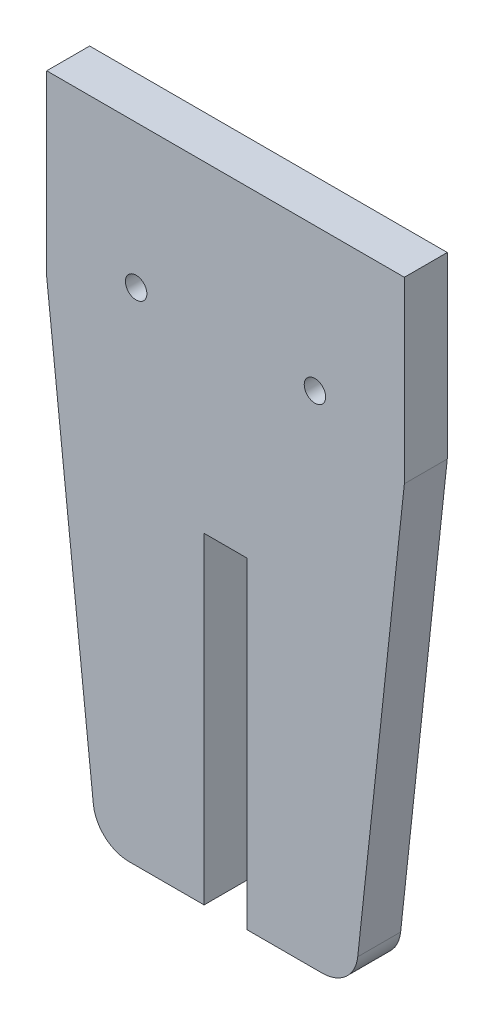
ISO-10303-21;
HEADER;
FILE_DESCRIPTION(('STEP AP214'),'2;1');
FILE_NAME('part.step','',(''),(''),'','','');
FILE_SCHEMA(('AUTOMOTIVE_DESIGN { 1 0 10303 214 1 1 1 1 }'));
ENDSEC;
DATA;
#1=APPLICATION_CONTEXT('core data for automotive mechanical design processes');
#2=APPLICATION_PROTOCOL_DEFINITION('international standard','automotive_design',2000,#1);
#3=PRODUCT_CONTEXT('',#1,'mechanical');
#4=PRODUCT('Part','Part','',(#3));
#5=PRODUCT_RELATED_PRODUCT_CATEGORY('part','',(#4));
#6=PRODUCT_DEFINITION_FORMATION('','',#4);
#7=PRODUCT_DEFINITION_CONTEXT('part definition',#1,'design');
#8=PRODUCT_DEFINITION('design','',#6,#7);
#9=PRODUCT_DEFINITION_SHAPE('','',#8);
#10=(LENGTH_UNIT() NAMED_UNIT(*) SI_UNIT(.MILLI.,.METRE.));
#11=(NAMED_UNIT(*) PLANE_ANGLE_UNIT() SI_UNIT($,.RADIAN.));
#12=(NAMED_UNIT(*) SI_UNIT($,.STERADIAN.) SOLID_ANGLE_UNIT());
#13=UNCERTAINTY_MEASURE_WITH_UNIT(LENGTH_MEASURE(1.E-05),#10,'distance_accuracy_value','');
#14=(GEOMETRIC_REPRESENTATION_CONTEXT(3) GLOBAL_UNCERTAINTY_ASSIGNED_CONTEXT((#13)) GLOBAL_UNIT_ASSIGNED_CONTEXT((#10,
#11,#12)) REPRESENTATION_CONTEXT('',''));
#15=CARTESIAN_POINT('',(0.,0.,0.));
#16=DIRECTION('',(0.,0.,1.));
#17=DIRECTION('',(1.,0.,0.));
#18=AXIS2_PLACEMENT_3D('',#15,#16,#17);
#19=CARTESIAN_POINT('',(18.,-90.,6.));
#20=DIRECTION('',(0.,1.,0.));
#21=DIRECTION('',(0.,0.,1.));
#22=AXIS2_PLACEMENT_3D('',#19,#20,#21);
#23=PLANE('',#22);
#24=DIRECTION('',(1.,0.,0.));
#25=VECTOR('',#24,1.);
#26=CARTESIAN_POINT('',(18.,-90.,0.));
#27=LINE('',#26,#25);
#28=CARTESIAN_POINT('',(3.,-90.,0.));
#29=VERTEX_POINT('',#28);
#30=CARTESIAN_POINT('',(13.5095510373289,-90.,0.));
#31=VERTEX_POINT('',#30);
#32=EDGE_CURVE('E156',#29,#31,#27,.T.);
#33=ORIENTED_EDGE('',*,*,#32,.T.);
#34=DIRECTION('',(0.,0.,-1.));
#35=VECTOR('',#34,1.);
#36=CARTESIAN_POINT('',(13.5095510373289,-90.,6.));
#37=LINE('',#36,#35);
#38=CARTESIAN_POINT('',(13.5095510373289,-90.,6.));
#39=VERTEX_POINT('',#38);
#40=EDGE_CURVE('E11',#31,#39,#37,.F.);
#41=ORIENTED_EDGE('',*,*,#40,.T.);
#42=DIRECTION('',(1.,0.,0.));
#43=VECTOR('',#42,1.);
#44=CARTESIAN_POINT('',(18.,-90.,6.));
#45=LINE('',#44,#43);
#46=CARTESIAN_POINT('',(3.,-90.,6.));
#47=VERTEX_POINT('',#46);
#48=EDGE_CURVE('E196',#47,#39,#45,.T.);
#49=ORIENTED_EDGE('',*,*,#48,.F.);
#50=DIRECTION('',(0.,0.,1.));
#51=VECTOR('',#50,1.);
#52=CARTESIAN_POINT('',(3.,-90.,0.));
#53=LINE('',#52,#51);
#54=EDGE_CURVE('E168',#29,#47,#53,.T.);
#55=ORIENTED_EDGE('',*,*,#54,.F.);
#56=EDGE_LOOP('',(#33,#41,#49,#55));
#57=FACE_BOUND('',#56,.T.);
#58=ADVANCED_FACE('F39',(#57),#23,.F.);
#59=CARTESIAN_POINT('',(-25.,0.,6.));
#60=DIRECTION('',(1.,0.,0.));
#61=DIRECTION('',(0.,1.,0.));
#62=AXIS2_PLACEMENT_3D('',#59,#60,#61);
#63=PLANE('',#62);
#64=DIRECTION('',(0.,-1.,0.));
#65=VECTOR('',#64,1.);
#66=CARTESIAN_POINT('',(-25.,0.,0.));
#67=LINE('',#66,#65);
#68=CARTESIAN_POINT('',(-25.,0.,0.));
#69=VERTEX_POINT('',#68);
#70=CARTESIAN_POINT('',(-25.,-25.,0.));
#71=VERTEX_POINT('',#70);
#72=EDGE_CURVE('E186',#69,#71,#67,.T.);
#73=ORIENTED_EDGE('',*,*,#72,.T.);
#74=DIRECTION('',(0.,0.,-1.));
#75=VECTOR('',#74,1.);
#76=CARTESIAN_POINT('',(-25.,-25.,6.));
#77=LINE('',#76,#75);
#78=CARTESIAN_POINT('',(-25.,-25.,6.));
#79=VERTEX_POINT('',#78);
#80=EDGE_CURVE('E239',#79,#71,#77,.T.);
#81=ORIENTED_EDGE('',*,*,#80,.F.);
#82=DIRECTION('',(0.,-1.,0.));
#83=VECTOR('',#82,1.);
#84=CARTESIAN_POINT('',(-25.,0.,6.));
#85=LINE('',#84,#83);
#86=CARTESIAN_POINT('',(-25.,0.,6.));
#87=VERTEX_POINT('',#86);
#88=EDGE_CURVE('E187',#87,#79,#85,.T.);
#89=ORIENTED_EDGE('',*,*,#88,.F.);
#90=DIRECTION('',(0.,0.,-1.));
#91=VECTOR('',#90,1.);
#92=CARTESIAN_POINT('',(-25.,0.,6.));
#93=LINE('',#92,#91);
#94=EDGE_CURVE('E209',#87,#69,#93,.T.);
#95=ORIENTED_EDGE('',*,*,#94,.T.);
#96=EDGE_LOOP('',(#73,#81,#89,#95));
#97=FACE_BOUND('',#96,.T.);
#98=ADVANCED_FACE('F285',(#97),#63,.F.);
#99=CARTESIAN_POINT('',(-25.,-25.,6.));
#100=DIRECTION('',(0.994251140256692,0.107073199719951,0.));
#101=DIRECTION('',(-0.107073199719951,0.994251140256692,0.));
#102=AXIS2_PLACEMENT_3D('',#99,#100,#101);
#103=PLANE('',#102);
#104=DIRECTION('',(0.107073199719951,-0.994251140256692,0.));
#105=VECTOR('',#104,1.);
#106=CARTESIAN_POINT('',(-25.,-25.,0.));
#107=LINE('',#106,#105);
#108=CARTESIAN_POINT('',(-18.4808067386123,-85.5353659985997,0.));
#109=VERTEX_POINT('',#108);
#110=EDGE_CURVE('E213',#71,#109,#107,.T.);
#111=ORIENTED_EDGE('',*,*,#110,.T.);
#112=DIRECTION('',(0.,0.,-1.));
#113=VECTOR('',#112,1.);
#114=CARTESIAN_POINT('',(-18.4808067386123,-85.5353659985997,6.));
#115=LINE('',#114,#113);
#116=CARTESIAN_POINT('',(-18.4808067386123,-85.5353659985997,6.));
#117=VERTEX_POINT('',#116);
#118=EDGE_CURVE('E253',#109,#117,#115,.F.);
#119=ORIENTED_EDGE('',*,*,#118,.T.);
#120=DIRECTION('',(0.107073199719951,-0.994251140256692,0.));
#121=VECTOR('',#120,1.);
#122=CARTESIAN_POINT('',(-25.,-25.,6.));
#123=LINE('',#122,#121);
#124=EDGE_CURVE('E191',#79,#117,#123,.T.);
#125=ORIENTED_EDGE('',*,*,#124,.F.);
#126=ORIENTED_EDGE('',*,*,#80,.T.);
#127=EDGE_LOOP('',(#111,#119,#125,#126));
#128=FACE_BOUND('',#127,.T.);
#129=ADVANCED_FACE('F287',(#128),#103,.F.);
#130=CARTESIAN_POINT('',(-13.5095510373289,-90.,6.));
#131=VERTEX_POINT('',#130);
#132=CARTESIAN_POINT('',(-3.,-90.,6.));
#133=VERTEX_POINT('',#132);
#134=EDGE_CURVE('E197',#131,#133,#45,.T.);
#135=ORIENTED_EDGE('',*,*,#134,.F.);
#136=DIRECTION('',(0.,0.,-1.));
#137=VECTOR('',#136,1.);
#138=CARTESIAN_POINT('',(-13.5095510373289,-90.,6.));
#139=LINE('',#138,#137);
#140=CARTESIAN_POINT('',(-13.5095510373289,-90.,0.));
#141=VERTEX_POINT('',#140);
#142=EDGE_CURVE('E243',#131,#141,#139,.T.);
#143=ORIENTED_EDGE('',*,*,#142,.T.);
#144=CARTESIAN_POINT('',(-3.,-90.,0.));
#145=VERTEX_POINT('',#144);
#146=EDGE_CURVE('E217',#141,#145,#27,.T.);
#147=ORIENTED_EDGE('',*,*,#146,.T.);
#148=DIRECTION('',(0.,0.,1.));
#149=VECTOR('',#148,1.);
#150=CARTESIAN_POINT('',(-3.,-90.,0.));
#151=LINE('',#150,#149);
#152=EDGE_CURVE('E172',#145,#133,#151,.T.);
#153=ORIENTED_EDGE('',*,*,#152,.T.);
#154=EDGE_LOOP('',(#135,#143,#147,#153));
#155=FACE_BOUND('',#154,.T.);
#156=ADVANCED_FACE('F295',(#155),#23,.F.);
#157=CARTESIAN_POINT('',(25.,-25.,6.));
#158=DIRECTION('',(-0.994251140256692,0.107073199719951,0.));
#159=DIRECTION('',(-0.107073199719951,-0.994251140256692,0.));
#160=AXIS2_PLACEMENT_3D('',#157,#158,#159);
#161=PLANE('',#160);
#162=DIRECTION('',(0.107073199719951,0.994251140256692,0.));
#163=VECTOR('',#162,1.);
#164=CARTESIAN_POINT('',(25.,-25.,6.));
#165=LINE('',#164,#163);
#166=CARTESIAN_POINT('',(18.4808067386123,-85.5353659985997,6.));
#167=VERTEX_POINT('',#166);
#168=CARTESIAN_POINT('',(25.,-25.,6.));
#169=VERTEX_POINT('',#168);
#170=EDGE_CURVE('E200',#167,#169,#165,.T.);
#171=ORIENTED_EDGE('',*,*,#170,.F.);
#172=DIRECTION('',(0.,0.,-1.));
#173=VECTOR('',#172,1.);
#174=CARTESIAN_POINT('',(18.4808067386123,-85.5353659985997,6.));
#175=LINE('',#174,#173);
#176=CARTESIAN_POINT('',(18.4808067386123,-85.5353659985997,0.));
#177=VERTEX_POINT('',#176);
#178=EDGE_CURVE('E49',#167,#177,#175,.T.);
#179=ORIENTED_EDGE('',*,*,#178,.T.);
#180=DIRECTION('',(0.107073199719951,0.994251140256692,0.));
#181=VECTOR('',#180,1.);
#182=CARTESIAN_POINT('',(25.,-25.,0.));
#183=LINE('',#182,#181);
#184=CARTESIAN_POINT('',(25.,-25.,0.));
#185=VERTEX_POINT('',#184);
#186=EDGE_CURVE('E220',#177,#185,#183,.T.);
#187=ORIENTED_EDGE('',*,*,#186,.T.);
#188=DIRECTION('',(0.,0.,-1.));
#189=VECTOR('',#188,1.);
#190=CARTESIAN_POINT('',(25.,-25.,6.));
#191=LINE('',#190,#189);
#192=EDGE_CURVE('E235',#169,#185,#191,.T.);
#193=ORIENTED_EDGE('',*,*,#192,.F.);
#194=EDGE_LOOP('',(#171,#179,#187,#193));
#195=FACE_BOUND('',#194,.T.);
#196=ADVANCED_FACE('F266',(#195),#161,.F.);
#197=CARTESIAN_POINT('',(25.,0.,6.));
#198=DIRECTION('',(-1.,0.,0.));
#199=DIRECTION('',(0.,-1.,0.));
#200=AXIS2_PLACEMENT_3D('',#197,#198,#199);
#201=PLANE('',#200);
#202=DIRECTION('',(0.,1.,0.));
#203=VECTOR('',#202,1.);
#204=CARTESIAN_POINT('',(25.,0.,0.));
#205=LINE('',#204,#203);
#206=CARTESIAN_POINT('',(25.,0.,0.));
#207=VERTEX_POINT('',#206);
#208=EDGE_CURVE('E223',#185,#207,#205,.T.);
#209=ORIENTED_EDGE('',*,*,#208,.T.);
#210=DIRECTION('',(0.,0.,-1.));
#211=VECTOR('',#210,1.);
#212=CARTESIAN_POINT('',(25.,0.,6.));
#213=LINE('',#212,#211);
#214=CARTESIAN_POINT('',(25.,0.,6.));
#215=VERTEX_POINT('',#214);
#216=EDGE_CURVE('E231',#215,#207,#213,.T.);
#217=ORIENTED_EDGE('',*,*,#216,.F.);
#218=DIRECTION('',(0.,1.,0.));
#219=VECTOR('',#218,1.);
#220=CARTESIAN_POINT('',(25.,0.,6.));
#221=LINE('',#220,#219);
#222=EDGE_CURVE('E203',#169,#215,#221,.T.);
#223=ORIENTED_EDGE('',*,*,#222,.F.);
#224=ORIENTED_EDGE('',*,*,#192,.T.);
#225=EDGE_LOOP('',(#209,#217,#223,#224));
#226=FACE_BOUND('',#225,.T.);
#227=ADVANCED_FACE('F274',(#226),#201,.F.);
#228=CARTESIAN_POINT('',(25.,0.,6.));
#229=DIRECTION('',(0.,-1.,0.));
#230=DIRECTION('',(0.,0.,-1.));
#231=AXIS2_PLACEMENT_3D('',#228,#229,#230);
#232=PLANE('',#231);
#233=DIRECTION('',(-1.,0.,0.));
#234=VECTOR('',#233,1.);
#235=CARTESIAN_POINT('',(25.,0.,0.));
#236=LINE('',#235,#234);
#237=EDGE_CURVE('E192',#207,#69,#236,.T.);
#238=ORIENTED_EDGE('',*,*,#237,.T.);
#239=ORIENTED_EDGE('',*,*,#94,.F.);
#240=DIRECTION('',(-1.,0.,0.));
#241=VECTOR('',#240,1.);
#242=CARTESIAN_POINT('',(25.,0.,6.));
#243=LINE('',#242,#241);
#244=EDGE_CURVE('E206',#215,#87,#243,.T.);
#245=ORIENTED_EDGE('',*,*,#244,.F.);
#246=ORIENTED_EDGE('',*,*,#216,.T.);
#247=EDGE_LOOP('',(#238,#239,#245,#246));
#248=FACE_BOUND('',#247,.T.);
#249=ADVANCED_FACE('F278',(#248),#232,.F.);
#250=CARTESIAN_POINT('',(0.,0.,6.));
#251=DIRECTION('',(0.,0.,-1.));
#252=DIRECTION('',(-1.,0.,0.));
#253=AXIS2_PLACEMENT_3D('',#250,#251,#252);
#254=PLANE('',#253);
#255=CARTESIAN_POINT('',(-12.5,-20.,6.));
#256=DIRECTION('',(0.,0.,1.));
#257=DIRECTION('',(1.,0.,0.));
#258=AXIS2_PLACEMENT_3D('',#255,#256,#257);
#259=CIRCLE('',#258,1.5);
#260=CARTESIAN_POINT('',(-11.,-20.,6.));
#261=VERTEX_POINT('',#260);
#262=EDGE_CURVE('E436',#261,#261,#259,.T.);
#263=ORIENTED_EDGE('',*,*,#262,.F.);
#264=EDGE_LOOP('',(#263));
#265=FACE_BOUND('',#264,.T.);
#266=CARTESIAN_POINT('',(12.5,-20.,6.));
#267=DIRECTION('',(0.,0.,-1.));
#268=DIRECTION('',(-1.,0.,0.));
#269=AXIS2_PLACEMENT_3D('',#266,#267,#268);
#270=CIRCLE('',#269,1.5);
#271=CARTESIAN_POINT('',(11.,-20.,6.));
#272=VERTEX_POINT('',#271);
#273=EDGE_CURVE('E162',#272,#272,#270,.T.);
#274=ORIENTED_EDGE('',*,*,#273,.T.);
#275=EDGE_LOOP('',(#274));
#276=FACE_BOUND('',#275,.T.);
#277=ORIENTED_EDGE('',*,*,#124,.T.);
#278=CARTESIAN_POINT('',(-13.5095510373289,-85.,6.));
#279=DIRECTION('',(0.,0.,-1.));
#280=DIRECTION('',(-1.,0.,0.));
#281=AXIS2_PLACEMENT_3D('',#278,#279,#280);
#282=CIRCLE('',#281,5.);
#283=EDGE_CURVE('E258',#117,#131,#282,.F.);
#284=ORIENTED_EDGE('',*,*,#283,.T.);
#285=ORIENTED_EDGE('',*,*,#134,.T.);
#286=DIRECTION('',(0.,1.,0.));
#287=VECTOR('',#286,1.);
#288=CARTESIAN_POINT('',(-3.,0.,6.));
#289=LINE('',#288,#287);
#290=CARTESIAN_POINT('',(-3.,-45.,6.));
#291=VERTEX_POINT('',#290);
#292=EDGE_CURVE('E180',#133,#291,#289,.T.);
#293=ORIENTED_EDGE('',*,*,#292,.T.);
#294=DIRECTION('',(1.,0.,0.));
#295=VECTOR('',#294,1.);
#296=CARTESIAN_POINT('',(0.,-45.,6.));
#297=LINE('',#296,#295);
#298=CARTESIAN_POINT('',(3.,-45.,6.));
#299=VERTEX_POINT('',#298);
#300=EDGE_CURVE('E171',#291,#299,#297,.T.);
#301=ORIENTED_EDGE('',*,*,#300,.T.);
#302=DIRECTION('',(0.,-1.,0.));
#303=VECTOR('',#302,1.);
#304=CARTESIAN_POINT('',(3.,0.,6.));
#305=LINE('',#304,#303);
#306=EDGE_CURVE('E137',#299,#47,#305,.T.);
#307=ORIENTED_EDGE('',*,*,#306,.T.);
#308=ORIENTED_EDGE('',*,*,#48,.T.);
#309=CARTESIAN_POINT('',(13.5095510373289,-85.,6.));
#310=DIRECTION('',(0.,0.,-1.));
#311=DIRECTION('',(-1.,0.,0.));
#312=AXIS2_PLACEMENT_3D('',#309,#310,#311);
#313=CIRCLE('',#312,5.);
#314=EDGE_CURVE('E57',#39,#167,#313,.F.);
#315=ORIENTED_EDGE('',*,*,#314,.T.);
#316=ORIENTED_EDGE('',*,*,#170,.T.);
#317=ORIENTED_EDGE('',*,*,#222,.T.);
#318=ORIENTED_EDGE('',*,*,#244,.T.);
#319=ORIENTED_EDGE('',*,*,#88,.T.);
#320=EDGE_LOOP('',(#277,#284,#285,#293,#301,#307,#308,#315,#316,#317,#318,#319));
#321=FACE_BOUND('',#320,.T.);
#322=ADVANCED_FACE('F281',(#265,#276,#321),#254,.F.);
#323=CARTESIAN_POINT('',(0.,0.,0.));
#324=DIRECTION('',(0.,0.,-1.));
#325=DIRECTION('',(-1.,0.,0.));
#326=AXIS2_PLACEMENT_3D('',#323,#324,#325);
#327=PLANE('',#326);
#328=CARTESIAN_POINT('',(-12.5,-20.,0.));
#329=DIRECTION('',(0.,0.,-1.));
#330=DIRECTION('',(-1.,0.,0.));
#331=AXIS2_PLACEMENT_3D('',#328,#329,#330);
#332=CIRCLE('',#331,1.5);
#333=CARTESIAN_POINT('',(-14.,-20.,0.));
#334=VERTEX_POINT('',#333);
#335=EDGE_CURVE('E43',#334,#334,#332,.F.);
#336=ORIENTED_EDGE('',*,*,#335,.T.);
#337=EDGE_LOOP('',(#336));
#338=FACE_BOUND('',#337,.T.);
#339=CARTESIAN_POINT('',(12.5,-20.,0.));
#340=DIRECTION('',(0.,0.,-1.));
#341=DIRECTION('',(-1.,0.,0.));
#342=AXIS2_PLACEMENT_3D('',#339,#340,#341);
#343=CIRCLE('',#342,1.5);
#344=CARTESIAN_POINT('',(11.,-20.,0.));
#345=VERTEX_POINT('',#344);
#346=EDGE_CURVE('E158',#345,#345,#343,.T.);
#347=ORIENTED_EDGE('',*,*,#346,.F.);
#348=EDGE_LOOP('',(#347));
#349=FACE_BOUND('',#348,.T.);
#350=ORIENTED_EDGE('',*,*,#146,.F.);
#351=CARTESIAN_POINT('',(-13.5095510373289,-85.,0.));
#352=DIRECTION('',(0.,0.,-1.));
#353=DIRECTION('',(-1.,0.,0.));
#354=AXIS2_PLACEMENT_3D('',#351,#352,#353);
#355=CIRCLE('',#354,5.);
#356=EDGE_CURVE('E250',#141,#109,#355,.T.);
#357=ORIENTED_EDGE('',*,*,#356,.T.);
#358=ORIENTED_EDGE('',*,*,#110,.F.);
#359=ORIENTED_EDGE('',*,*,#72,.F.);
#360=ORIENTED_EDGE('',*,*,#237,.F.);
#361=ORIENTED_EDGE('',*,*,#208,.F.);
#362=ORIENTED_EDGE('',*,*,#186,.F.);
#363=CARTESIAN_POINT('',(13.5095510373289,-85.,0.));
#364=DIRECTION('',(0.,0.,-1.));
#365=DIRECTION('',(-1.,0.,0.));
#366=AXIS2_PLACEMENT_3D('',#363,#364,#365);
#367=CIRCLE('',#366,5.);
#368=EDGE_CURVE('E247',#177,#31,#367,.T.);
#369=ORIENTED_EDGE('',*,*,#368,.T.);
#370=ORIENTED_EDGE('',*,*,#32,.F.);
#371=DIRECTION('',(0.,1.,0.));
#372=VECTOR('',#371,1.);
#373=CARTESIAN_POINT('',(3.,-45.,0.));
#374=LINE('',#373,#372);
#375=CARTESIAN_POINT('',(3.,-45.,0.));
#376=VERTEX_POINT('',#375);
#377=EDGE_CURVE('E134',#29,#376,#374,.T.);
#378=ORIENTED_EDGE('',*,*,#377,.T.);
#379=DIRECTION('',(-1.,0.,0.));
#380=VECTOR('',#379,1.);
#381=CARTESIAN_POINT('',(-3.,-45.,0.));
#382=LINE('',#381,#380);
#383=CARTESIAN_POINT('',(-3.,-45.,0.));
#384=VERTEX_POINT('',#383);
#385=EDGE_CURVE('E146',#376,#384,#382,.T.);
#386=ORIENTED_EDGE('',*,*,#385,.T.);
#387=DIRECTION('',(0.,-1.,0.));
#388=VECTOR('',#387,1.);
#389=CARTESIAN_POINT('',(-3.,-45.,0.));
#390=LINE('',#389,#388);
#391=EDGE_CURVE('E142',#384,#145,#390,.T.);
#392=ORIENTED_EDGE('',*,*,#391,.T.);
#393=EDGE_LOOP('',(#350,#357,#358,#359,#360,#361,#362,#369,#370,#378,#386,#392));
#394=FACE_BOUND('',#393,.T.);
#395=ADVANCED_FACE('F155',(#338,#349,#394),#327,.T.);
#396=CARTESIAN_POINT('',(3.,-45.,0.));
#397=DIRECTION('',(1.,0.,0.));
#398=DIRECTION('',(0.,1.,0.));
#399=AXIS2_PLACEMENT_3D('',#396,#397,#398);
#400=PLANE('',#399);
#401=DIRECTION('',(0.,0.,1.));
#402=VECTOR('',#401,1.);
#403=CARTESIAN_POINT('',(3.,-45.,0.));
#404=LINE('',#403,#402);
#405=EDGE_CURVE('E130',#376,#299,#404,.T.);
#406=ORIENTED_EDGE('',*,*,#405,.F.);
#407=ORIENTED_EDGE('',*,*,#377,.F.);
#408=ORIENTED_EDGE('',*,*,#54,.T.);
#409=ORIENTED_EDGE('',*,*,#306,.F.);
#410=EDGE_LOOP('',(#406,#407,#408,#409));
#411=FACE_BOUND('',#410,.T.);
#412=ADVANCED_FACE('F132',(#411),#400,.F.);
#413=CARTESIAN_POINT('',(-3.,-45.,0.));
#414=DIRECTION('',(-1.,0.,0.));
#415=DIRECTION('',(0.,-1.,0.));
#416=AXIS2_PLACEMENT_3D('',#413,#414,#415);
#417=PLANE('',#416);
#418=ORIENTED_EDGE('',*,*,#152,.F.);
#419=ORIENTED_EDGE('',*,*,#391,.F.);
#420=DIRECTION('',(0.,0.,1.));
#421=VECTOR('',#420,1.);
#422=CARTESIAN_POINT('',(-3.,-45.,0.));
#423=LINE('',#422,#421);
#424=EDGE_CURVE('E141',#384,#291,#423,.T.);
#425=ORIENTED_EDGE('',*,*,#424,.T.);
#426=ORIENTED_EDGE('',*,*,#292,.F.);
#427=EDGE_LOOP('',(#418,#419,#425,#426));
#428=FACE_BOUND('',#427,.T.);
#429=ADVANCED_FACE('F298',(#428),#417,.F.);
#430=CARTESIAN_POINT('',(-3.,-45.,0.));
#431=DIRECTION('',(0.,1.,0.));
#432=DIRECTION('',(0.,0.,1.));
#433=AXIS2_PLACEMENT_3D('',#430,#431,#432);
#434=PLANE('',#433);
#435=ORIENTED_EDGE('',*,*,#424,.F.);
#436=ORIENTED_EDGE('',*,*,#385,.F.);
#437=ORIENTED_EDGE('',*,*,#405,.T.);
#438=ORIENTED_EDGE('',*,*,#300,.F.);
#439=EDGE_LOOP('',(#435,#436,#437,#438));
#440=FACE_BOUND('',#439,.T.);
#441=ADVANCED_FACE('F147',(#440),#434,.F.);
#442=CARTESIAN_POINT('',(-13.5095510373289,-85.,6.));
#443=DIRECTION('',(0.,0.,-1.));
#444=DIRECTION('',(-1.,0.,0.));
#445=AXIS2_PLACEMENT_3D('',#442,#443,#444);
#446=CYLINDRICAL_SURFACE('',#445,5.);
#447=ORIENTED_EDGE('',*,*,#283,.F.);
#448=ORIENTED_EDGE('',*,*,#118,.F.);
#449=ORIENTED_EDGE('',*,*,#356,.F.);
#450=ORIENTED_EDGE('',*,*,#142,.F.);
#451=EDGE_LOOP('',(#447,#448,#449,#450));
#452=FACE_BOUND('',#451,.T.);
#453=ADVANCED_FACE('F290',(#452),#446,.T.);
#454=CARTESIAN_POINT('',(13.5095510373289,-85.,6.));
#455=DIRECTION('',(0.,0.,-1.));
#456=DIRECTION('',(-1.,0.,0.));
#457=AXIS2_PLACEMENT_3D('',#454,#455,#456);
#458=CYLINDRICAL_SURFACE('',#457,5.);
#459=ORIENTED_EDGE('',*,*,#314,.F.);
#460=ORIENTED_EDGE('',*,*,#40,.F.);
#461=ORIENTED_EDGE('',*,*,#368,.F.);
#462=ORIENTED_EDGE('',*,*,#178,.F.);
#463=EDGE_LOOP('',(#459,#460,#461,#462));
#464=FACE_BOUND('',#463,.T.);
#465=ADVANCED_FACE('F41',(#464),#458,.T.);
#466=CARTESIAN_POINT('',(12.5,-20.,6.));
#467=DIRECTION('',(0.,0.,-1.));
#468=DIRECTION('',(-1.,0.,0.));
#469=AXIS2_PLACEMENT_3D('',#466,#467,#468);
#470=CYLINDRICAL_SURFACE('',#469,1.5);
#471=ORIENTED_EDGE('',*,*,#346,.T.);
#472=EDGE_LOOP('',(#471));
#473=FACE_BOUND('',#472,.T.);
#474=ORIENTED_EDGE('',*,*,#273,.F.);
#475=EDGE_LOOP('',(#474));
#476=FACE_BOUND('',#475,.T.);
#477=ADVANCED_FACE('F302',(#473,#476),#470,.F.);
#478=CARTESIAN_POINT('',(-12.5,-20.,6.));
#479=DIRECTION('',(0.,0.,-1.));
#480=DIRECTION('',(-1.,0.,0.));
#481=AXIS2_PLACEMENT_3D('',#478,#479,#480);
#482=CYLINDRICAL_SURFACE('',#481,1.5);
#483=ORIENTED_EDGE('',*,*,#335,.F.);
#484=EDGE_LOOP('',(#483));
#485=FACE_BOUND('',#484,.T.);
#486=ORIENTED_EDGE('',*,*,#262,.T.);
#487=EDGE_LOOP('',(#486));
#488=FACE_BOUND('',#487,.T.);
#489=ADVANCED_FACE('F307',(#485,#488),#482,.F.);
#490=CLOSED_SHELL('',(#58,#98,#129,#156,#196,#227,#249,#322,#395,#412,#429,#441,#453,#465,#477,#489));
#491=MANIFOLD_SOLID_BREP('B2',#490);
#492=ADVANCED_BREP_SHAPE_REPRESENTATION('',(#18,#491),#14);
#493=SHAPE_DEFINITION_REPRESENTATION(#9,#492);
ENDSEC;
END-ISO-10303-21;
